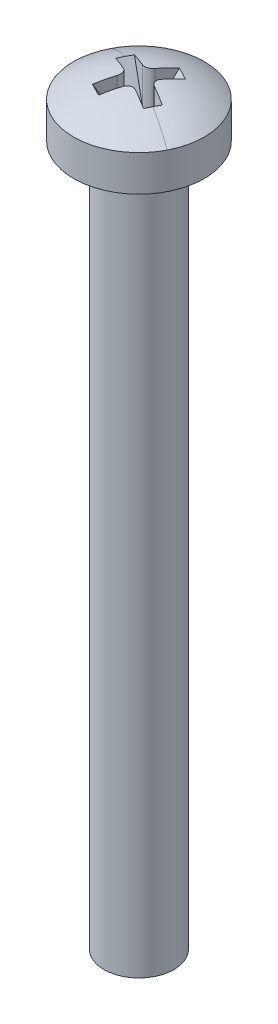
ISO-10303-21;
HEADER;
FILE_DESCRIPTION(('STEP AP214'),'2;1');
FILE_NAME('part.step','',(''),(''),'','','');
FILE_SCHEMA(('AUTOMOTIVE_DESIGN { 1 0 10303 214 1 1 1 1 }'));
ENDSEC;
DATA;
#1=APPLICATION_CONTEXT('core data for automotive mechanical design processes');
#2=APPLICATION_PROTOCOL_DEFINITION('international standard','automotive_design',2000,#1);
#3=PRODUCT_CONTEXT('',#1,'mechanical');
#4=PRODUCT('Part','Part','',(#3));
#5=PRODUCT_RELATED_PRODUCT_CATEGORY('part','',(#4));
#6=PRODUCT_DEFINITION_FORMATION('','',#4);
#7=PRODUCT_DEFINITION_CONTEXT('part definition',#1,'design');
#8=PRODUCT_DEFINITION('design','',#6,#7);
#9=PRODUCT_DEFINITION_SHAPE('','',#8);
#10=(LENGTH_UNIT() NAMED_UNIT(*) SI_UNIT(.MILLI.,.METRE.));
#11=(NAMED_UNIT(*) PLANE_ANGLE_UNIT() SI_UNIT($,.RADIAN.));
#12=(NAMED_UNIT(*) SI_UNIT($,.STERADIAN.) SOLID_ANGLE_UNIT());
#13=UNCERTAINTY_MEASURE_WITH_UNIT(LENGTH_MEASURE(1.E-05),#10,'distance_accuracy_value','');
#14=(GEOMETRIC_REPRESENTATION_CONTEXT(3) GLOBAL_UNCERTAINTY_ASSIGNED_CONTEXT((#13)) GLOBAL_UNIT_ASSIGNED_CONTEXT((#10,
#11,#12)) REPRESENTATION_CONTEXT('',''));
#15=CARTESIAN_POINT('',(0.,0.,0.));
#16=DIRECTION('',(0.,0.,1.));
#17=DIRECTION('',(1.,0.,0.));
#18=AXIS2_PLACEMENT_3D('',#15,#16,#17);
#19=CARTESIAN_POINT('',(-5.99075847111344,45.5704195270786,-64.1039085041195));
#20=DIRECTION('',(0.,-1.,0.));
#21=DIRECTION('',(1.,0.,0.));
#22=AXIS2_PLACEMENT_3D('',#19,#20,#21);
#23=PLANE('',#22);
#24=DIRECTION('',(0.45678408331748,0.,-0.889577597080665));
#25=VECTOR('',#24,1.);
#26=CARTESIAN_POINT('',(-6.47325458568408,45.5704195270786,-63.6678902764426));
#27=LINE('',#26,#25);
#28=CARTESIAN_POINT('',(-6.47325458568409,45.5704195270786,-63.6678902764426));
#29=VERTEX_POINT('',#28);
#30=CARTESIAN_POINT('',(-6.19163021265788,45.5704195270786,-64.2163479442679));
#31=VERTEX_POINT('',#30);
#32=EDGE_CURVE('E144',#29,#31,#27,.T.);
#33=ORIENTED_EDGE('',*,*,#32,.F.);
#34=CARTESIAN_POINT('',(-6.66873742522337,45.5704195270786,-63.4403238917421));
#35=DIRECTION('',(0.,-1.,0.));
#36=DIRECTION('',(1.,0.,0.));
#37=AXIS2_PLACEMENT_3D('',#34,#35,#36);
#38=CIRCLE('',#37,0.299999999999998);
#39=CARTESIAN_POINT('',(-6.37726836125233,45.5704195270786,-63.3692902043266));
#40=VERTEX_POINT('',#39);
#41=EDGE_CURVE('E324',#40,#29,#38,.F.);
#42=ORIENTED_EDGE('',*,*,#41,.F.);
#43=DIRECTION('',(-0.889577597080666,0.,-0.456784083317477));
#44=VECTOR('',#43,1.);
#45=CARTESIAN_POINT('',(-5.82881069342708,45.5704195270786,-63.0876658313004));
#46=LINE('',#45,#44);
#47=CARTESIAN_POINT('',(-5.82881069342707,45.5704195270786,-63.0876658313004));
#48=VERTEX_POINT('',#47);
#49=EDGE_CURVE('E170',#48,#40,#46,.T.);
#50=ORIENTED_EDGE('',*,*,#49,.F.);
#51=CARTESIAN_POINT('',(-5.60124430872657,45.5704195270786,-62.8921829917611));
#52=DIRECTION('',(0.,-1.,0.));
#53=DIRECTION('',(1.,0.,0.));
#54=AXIS2_PLACEMENT_3D('',#51,#52,#53);
#55=CIRCLE('',#54,0.299999999999998);
#56=CARTESIAN_POINT('',(-5.53021062131109,45.5704195270786,-63.1836520557322));
#57=VERTEX_POINT('',#56);
#58=EDGE_CURVE('E342',#57,#48,#55,.F.);
#59=ORIENTED_EDGE('',*,*,#58,.F.);
#60=DIRECTION('',(-0.456784083317481,0.,0.889577597080664));
#61=VECTOR('',#60,1.);
#62=CARTESIAN_POINT('',(-5.24858624828488,45.5704195270786,-63.7321097235574));
#63=LINE('',#62,#61);
#64=CARTESIAN_POINT('',(-5.24858624828488,45.5704195270786,-63.7321097235574));
#65=VERTEX_POINT('',#64);
#66=EDGE_CURVE('E174',#65,#57,#63,.T.);
#67=ORIENTED_EDGE('',*,*,#66,.F.);
#68=CARTESIAN_POINT('',(-5.0531034087456,45.5704195270786,-63.9596761082579));
#69=DIRECTION('',(0.,-1.,0.));
#70=DIRECTION('',(1.,0.,0.));
#71=AXIS2_PLACEMENT_3D('',#68,#69,#70);
#72=CIRCLE('',#71,0.299999999999998);
#73=CARTESIAN_POINT('',(-5.34457247271664,45.5704195270786,-64.0307097956734));
#74=VERTEX_POINT('',#73);
#75=EDGE_CURVE('E379',#74,#65,#72,.F.);
#76=ORIENTED_EDGE('',*,*,#75,.F.);
#77=DIRECTION('',(0.889577597080657,0.,0.456784083317495));
#78=VECTOR('',#77,1.);
#79=CARTESIAN_POINT('',(-5.89303014054189,45.5704195270786,-64.3123341686996));
#80=LINE('',#79,#78);
#81=CARTESIAN_POINT('',(-5.89303014054189,45.5704195270786,-64.3123341686996));
#82=VERTEX_POINT('',#81);
#83=EDGE_CURVE('E147',#82,#74,#80,.T.);
#84=ORIENTED_EDGE('',*,*,#83,.F.);
#85=CARTESIAN_POINT('',(-6.12059652524239,45.5704195270786,-64.5078170082389));
#86=DIRECTION('',(0.,-1.,0.));
#87=DIRECTION('',(1.,0.,0.));
#88=AXIS2_PLACEMENT_3D('',#85,#86,#87);
#89=CIRCLE('',#88,0.299999999999998);
#90=EDGE_CURVE('E21',#31,#82,#89,.F.);
#91=ORIENTED_EDGE('',*,*,#90,.F.);
#92=EDGE_LOOP('',(#33,#42,#50,#59,#67,#76,#84,#91));
#93=FACE_BOUND('',#92,.T.);
#94=ADVANCED_FACE('F18',(#93),#23,.F.);
#95=CARTESIAN_POINT('',(-6.12059652524239,45.5704195270786,-64.5078170082389));
#96=DIRECTION('',(0.,-1.,0.));
#97=DIRECTION('',(1.,0.,0.));
#98=AXIS2_PLACEMENT_3D('',#95,#96,#97);
#99=CYLINDRICAL_SURFACE('',#98,0.299999999999998);
#100=DIRECTION('',(0.,1.,0.));
#101=VECTOR('',#100,1.);
#102=CARTESIAN_POINT('',(-5.8537232461182,45.5704195270786,-64.3707817832437));
#103=LINE('',#102,#101);
#104=CARTESIAN_POINT('',(-5.85372324611809,47.2052151838135,-64.3707817832439));
#105=VERTEX_POINT('',#104);
#106=CARTESIAN_POINT('',(-5.8537232461182,45.6915738002666,-64.3707817832437));
#107=VERTEX_POINT('',#106);
#108=EDGE_CURVE('E471',#105,#107,#103,.F.);
#109=ORIENTED_EDGE('',*,*,#108,.F.);
#110=CARTESIAN_POINT('',(-5.85372324611797,47.2052151838135,-64.3707817832441));
#111=CARTESIAN_POINT('',(-5.86133816394046,47.2072391497238,-64.3559197222575));
#112=CARTESIAN_POINT('',(-5.87022810029549,47.2090920081056,-64.3416898597909));
#113=CARTESIAN_POINT('',(-5.89026616196918,47.2124095103203,-64.3148777604995));
#114=CARTESIAN_POINT('',(-5.90141341489537,47.2138743036267,-64.30229489024));
#115=CARTESIAN_POINT('',(-5.92569024937354,47.2163723024023,-64.2791387331639));
#116=CARTESIAN_POINT('',(-5.93882140343957,47.2174051630366,-64.2685670556464));
#117=CARTESIAN_POINT('',(-5.96668220598338,47.2190067962014,-64.2497616227292));
#118=CARTESIAN_POINT('',(-5.98141132740932,47.2195757212261,-64.2415270996949));
#119=CARTESIAN_POINT('',(-6.01193066503966,47.2202300218207,-64.2276914439237));
#120=CARTESIAN_POINT('',(-6.02771179453626,47.2203191028308,-64.2220704386826));
#121=CARTESIAN_POINT('',(-6.05998458234822,47.2200210020274,-64.2135301553134));
#122=CARTESIAN_POINT('',(-6.07647622577491,47.2196338301889,-64.2106108206013));
#123=CARTESIAN_POINT('',(-6.10964071949796,47.2183971460226,-64.2075563558061));
#124=CARTESIAN_POINT('',(-6.12631278109109,47.2175491814301,-64.2074119638093));
#125=CARTESIAN_POINT('',(-6.15942170451941,47.2154168278946,-64.2098776194737));
#126=CARTESIAN_POINT('',(-6.17585864924176,47.2141325969105,-64.2124866709154));
#127=CARTESIAN_POINT('',(-6.20334850594143,47.2115984533834,-64.2192165830731));
#128=CARTESIAN_POINT('',(-6.21457711846517,47.2104471601799,-64.2226771820594));
#129=CARTESIAN_POINT('',(-6.23652039330203,47.2079631810633,-64.2308713279406));
#130=CARTESIAN_POINT('',(-6.24723576919969,47.2066307575083,-64.2356030431909));
#131=CARTESIAN_POINT('',(-6.25763175023764,47.2052151838136,-64.2409437291147));
#132=B_SPLINE_CURVE_WITH_KNOTS('',3,(#110,#111,#112,#113,#114,#115,#116,#117,#118,#119,#120,
#121,#122,#123,#124,#125,#126,#127,#128,#129,#130,#131),.UNSPECIFIED.,.F.,.F.,(4,2,2,2,2,2,2,2,
2,2,4),(0.,0.0504039946641569,0.100788546583145,0.151213246756537,0.201621365804866,
0.251639660452755,0.301656907488732,0.351507183085358,0.401339428604923,0.436680554237757,
0.471971024908668),.UNSPECIFIED.);
#133=CARTESIAN_POINT('',(-6.25763175023764,47.2052151838136,-64.2409437291147));
#134=VERTEX_POINT('',#133);
#135=EDGE_CURVE('E150',#105,#134,#132,.T.);
#136=ORIENTED_EDGE('',*,*,#135,.T.);
#137=DIRECTION('',(0.,1.,0.));
#138=VECTOR('',#137,1.);
#139=CARTESIAN_POINT('',(-6.25763175023763,45.5704195270786,-64.2409437291147));
#140=LINE('',#139,#138);
#141=CARTESIAN_POINT('',(-6.25763175023764,45.6915738002666,-64.2409437291147));
#142=VERTEX_POINT('',#141);
#143=EDGE_CURVE('E156',#142,#134,#140,.T.);
#144=ORIENTED_EDGE('',*,*,#143,.F.);
#145=CARTESIAN_POINT('',(-6.12059652524239,45.6915738002666,-64.5078170082389));
#146=DIRECTION('',(0.770396797709372,0.500000000000001,0.395586620197326));
#147=DIRECTION('',(0.444788798540333,-0.866025403784438,0.228392041658741));
#148=AXIS2_PLACEMENT_3D('',#145,#146,#147);
#149=ELLIPSE('',#148,0.599999999999995,0.299999999999998);
#150=EDGE_CURVE('E152',#31,#142,#149,.F.);
#151=ORIENTED_EDGE('',*,*,#150,.F.);
#152=ORIENTED_EDGE('',*,*,#90,.T.);
#153=CARTESIAN_POINT('',(-6.12059652524239,45.6915738002666,-64.5078170082389));
#154=DIRECTION('',(-0.395586620197326,0.500000000000001,0.770396797709372));
#155=DIRECTION('',(-0.228392041658741,-0.866025403784438,0.444788798540333));
#156=AXIS2_PLACEMENT_3D('',#153,#154,#155);
#157=ELLIPSE('',#156,0.599999999999995,0.299999999999998);
#158=EDGE_CURVE('E179',#107,#82,#157,.F.);
#159=ORIENTED_EDGE('',*,*,#158,.F.);
#160=EDGE_LOOP('',(#109,#136,#144,#151,#152,#159));
#161=FACE_BOUND('',#160,.T.);
#162=ADVANCED_FACE('F154',(#161),#99,.T.);
#163=CARTESIAN_POINT('',(-5.17574429200826,47.2504195270786,-65.034366395621));
#164=DIRECTION('',(-0.395586620197326,0.500000000000001,0.770396797709372));
#165=DIRECTION('',(0.,-0.838820499650936,0.544408090833847));
#166=AXIS2_PLACEMENT_3D('',#163,#164,#165);
#167=PLANE('',#166);
#168=ORIENTED_EDGE('',*,*,#83,.T.);
#169=CARTESIAN_POINT('',(-5.0531034087456,45.6915738002666,-63.9596761082579));
#170=DIRECTION('',(-0.395586620197326,0.500000000000001,0.770396797709372));
#171=DIRECTION('',(-0.228392041658741,-0.866025403784438,0.444788798540333));
#172=AXIS2_PLACEMENT_3D('',#169,#170,#171);
#173=ELLIPSE('',#172,0.599999999999995,0.299999999999998);
#174=CARTESIAN_POINT('',(-5.3199766878698,45.6915738002666,-64.0967113332532));
#175=VERTEX_POINT('',#174);
#176=EDGE_CURVE('E178',#175,#74,#173,.T.);
#177=ORIENTED_EDGE('',*,*,#176,.F.);
#178=DIRECTION('',(-0.228392041658741,-0.866025403784438,0.444788798540333));
#179=VECTOR('',#178,1.);
#180=CARTESIAN_POINT('',(-4.96272146553195,47.0462273859704,-64.7924585228743));
#181=LINE('',#180,#179);
#182=CARTESIAN_POINT('',(-4.96272146553195,47.0462273859704,-64.7924585228744));
#183=VERTEX_POINT('',#182);
#184=EDGE_CURVE('E462',#183,#175,#181,.T.);
#185=ORIENTED_EDGE('',*,*,#184,.F.);
#186=CARTESIAN_POINT('',(-4.96272146553195,47.0462273859704,-64.7924585228744));
#187=CARTESIAN_POINT('',(-5.0502661956498,47.0515853639129,-64.8408887772388));
#188=CARTESIAN_POINT('',(-5.13851744056275,47.0542643528841,-64.8879431085869));
#189=CARTESIAN_POINT('',(-5.31643295997883,47.054264352884,-64.9792999252504));
#190=CARTESIAN_POINT('',(-5.40609723448197,47.0515853639128,-65.0236024105659));
#191=CARTESIAN_POINT('',(-5.49646802378019,47.0462273859703,-65.066528972865));
#192=B_SPLINE_CURVE_WITH_KNOTS('',3,(#186,#187,#188,#189,#190,#191),.UNSPECIFIED.,.F.,.F.,(4,2,
4),(0.,0.300143505315177,0.600287010630352),.UNSPECIFIED.);
#193=CARTESIAN_POINT('',(-5.49646802378028,47.0462273859704,-65.0665289728649));
#194=VERTEX_POINT('',#193);
#195=EDGE_CURVE('E384',#183,#194,#192,.T.);
#196=ORIENTED_EDGE('',*,*,#195,.T.);
#197=DIRECTION('',(0.228392041658738,0.866025403784442,-0.444788798540327));
#198=VECTOR('',#197,1.);
#199=CARTESIAN_POINT('',(-5.8537232461182,45.6915738002666,-64.3707817832437));
#200=LINE('',#199,#198);
#201=EDGE_CURVE('E468',#107,#194,#200,.T.);
#202=ORIENTED_EDGE('',*,*,#201,.F.);
#203=ORIENTED_EDGE('',*,*,#158,.T.);
#204=EDGE_LOOP('',(#168,#177,#185,#196,#202,#203));
#205=FACE_BOUND('',#204,.T.);
#206=ADVANCED_FACE('F393',(#205),#167,.T.);
#207=CARTESIAN_POINT('',(-5.0531034087456,45.5704195270786,-63.9596761082579));
#208=DIRECTION('',(0.,-1.,0.));
#209=DIRECTION('',(1.,0.,0.));
#210=AXIS2_PLACEMENT_3D('',#207,#208,#209);
#211=CYLINDRICAL_SURFACE('',#210,0.299999999999998);
#212=DIRECTION('',(0.,1.,0.));
#213=VECTOR('',#212,1.);
#214=CARTESIAN_POINT('',(-5.19013863374084,45.5704195270786,-63.6928028291337));
#215=LINE('',#214,#213);
#216=CARTESIAN_POINT('',(-5.19013863374084,47.2052151838136,-63.6928028291337));
#217=VERTEX_POINT('',#216);
#218=CARTESIAN_POINT('',(-5.19013863374084,45.6915738002666,-63.6928028291337));
#219=VERTEX_POINT('',#218);
#220=EDGE_CURVE('E459',#217,#219,#215,.F.);
#221=ORIENTED_EDGE('',*,*,#220,.F.);
#222=CARTESIAN_POINT('',(-5.19013863374084,47.2052151838136,-63.6928028291337));
#223=CARTESIAN_POINT('',(-5.20500069472743,47.2072391497239,-63.7004177469562));
#224=CARTESIAN_POINT('',(-5.21923055719406,47.2090920081056,-63.7093076833113));
#225=CARTESIAN_POINT('',(-5.24604265648538,47.2124095103203,-63.729345744985));
#226=CARTESIAN_POINT('',(-5.25862552674487,47.2138743036267,-63.7404929979113));
#227=CARTESIAN_POINT('',(-5.28178168382093,47.2163723024024,-63.7647698323895));
#228=CARTESIAN_POINT('',(-5.29235336133841,47.2174051630366,-63.7779009864555));
#229=CARTESIAN_POINT('',(-5.31115879425561,47.2190067962014,-63.8057617889993));
#230=CARTESIAN_POINT('',(-5.31939331728981,47.2195757212261,-63.8204909104253));
#231=CARTESIAN_POINT('',(-5.33322897306101,47.2202300218208,-63.8510102480556));
#232=CARTESIAN_POINT('',(-5.33884997830209,47.2203191028308,-63.8667913775523));
#233=CARTESIAN_POINT('',(-5.34739026167116,47.2200210020273,-63.8990641653642));
#234=CARTESIAN_POINT('',(-5.35030959638322,47.2196338301889,-63.9155558087909));
#235=CARTESIAN_POINT('',(-5.35336406117837,47.2183971460226,-63.948720302514));
#236=CARTESIAN_POINT('',(-5.35350845317518,47.2175491814301,-63.9653923641071));
#237=CARTESIAN_POINT('',(-5.35104279751071,47.2154168278946,-63.9985012875354));
#238=CARTESIAN_POINT('',(-5.34843374606896,47.2141325969105,-64.0149382322578));
#239=CARTESIAN_POINT('',(-5.34170383391125,47.2115984533834,-64.0424280889574));
#240=CARTESIAN_POINT('',(-5.33824323492495,47.2104471601799,-64.0536567014811));
#241=CARTESIAN_POINT('',(-5.33004908904374,47.2079631810633,-64.075599976318));
#242=CARTESIAN_POINT('',(-5.32531737379346,47.2066307575082,-64.0863153522157));
#243=CARTESIAN_POINT('',(-5.31997668786957,47.2052151838135,-64.0967113332536));
#244=B_SPLINE_CURVE_WITH_KNOTS('',3,(#222,#223,#224,#225,#226,#227,#228,#229,#230,#231,#232,
#233,#234,#235,#236,#237,#238,#239,#240,#241,#242,#243),.UNSPECIFIED.,.F.,.F.,(4,2,2,2,2,2,2,2,
2,2,4),(0.,0.0504039946641652,0.100788546583157,0.15121324675655,0.201621365804864,
0.251639660452754,0.301656907488725,0.351507183085339,0.401339428604909,0.436680554237725,
0.471971024908633),.UNSPECIFIED.);
#245=CARTESIAN_POINT('',(-5.31997668786969,47.2052151838135,-64.0967113332534));
#246=VERTEX_POINT('',#245);
#247=EDGE_CURVE('E373',#217,#246,#244,.T.);
#248=ORIENTED_EDGE('',*,*,#247,.T.);
#249=DIRECTION('',(0.,1.,0.));
#250=VECTOR('',#249,1.);
#251=CARTESIAN_POINT('',(-5.3199766878698,45.5704195270786,-64.0967113332532));
#252=LINE('',#251,#250);
#253=EDGE_CURVE('E465',#175,#246,#252,.T.);
#254=ORIENTED_EDGE('',*,*,#253,.F.);
#255=ORIENTED_EDGE('',*,*,#176,.T.);
#256=ORIENTED_EDGE('',*,*,#75,.T.);
#257=CARTESIAN_POINT('',(-5.0531034087456,45.6915738002666,-63.9596761082579));
#258=DIRECTION('',(-0.770396797709372,0.500000000000001,-0.395586620197326));
#259=DIRECTION('',(-0.444788798540333,-0.866025403784438,-0.228392041658741));
#260=AXIS2_PLACEMENT_3D('',#257,#258,#259);
#261=ELLIPSE('',#260,0.599999999999994,0.299999999999998);
#262=EDGE_CURVE('E177',#219,#65,#261,.F.);
#263=ORIENTED_EDGE('',*,*,#262,.F.);
#264=EDGE_LOOP('',(#221,#248,#254,#255,#256,#263));
#265=FACE_BOUND('',#264,.T.);
#266=ADVANCED_FACE('F353',(#265),#211,.T.);
#267=CARTESIAN_POINT('',(-4.52655402136349,47.2504195270786,-63.0148238750238));
#268=DIRECTION('',(-0.770396797709372,0.500000000000001,-0.395586620197326));
#269=DIRECTION('',(-0.544408090833847,-0.838820499650936,0.));
#270=AXIS2_PLACEMENT_3D('',#267,#268,#269);
#271=PLANE('',#270);
#272=CARTESIAN_POINT('',(-5.60124430872657,45.6915738002666,-62.8921829917611));
#273=DIRECTION('',(-0.770396797709372,0.500000000000001,-0.395586620197326));
#274=DIRECTION('',(-0.444788798540333,-0.866025403784438,-0.228392041658741));
#275=AXIS2_PLACEMENT_3D('',#272,#273,#274);
#276=ELLIPSE('',#275,0.599999999999994,0.299999999999998);
#277=CARTESIAN_POINT('',(-5.46420908373133,45.6915738002666,-63.1590562708853));
#278=VERTEX_POINT('',#277);
#279=EDGE_CURVE('E176',#278,#57,#276,.T.);
#280=ORIENTED_EDGE('',*,*,#279,.F.);
#281=DIRECTION('',(-0.444788798540327,-0.866025403784442,-0.228392041658738));
#282=VECTOR('',#281,1.);
#283=CARTESIAN_POINT('',(-4.76846189411017,47.0462273859704,-62.8018010485475));
#284=LINE('',#283,#282);
#285=CARTESIAN_POINT('',(-4.76846189411016,47.0462273859704,-62.8018010485475));
#286=VERTEX_POINT('',#285);
#287=EDGE_CURVE('E450',#286,#278,#284,.T.);
#288=ORIENTED_EDGE('',*,*,#287,.F.);
#289=CARTESIAN_POINT('',(-4.76846189411015,47.0462273859704,-62.8018010485475));
#290=CARTESIAN_POINT('',(-4.74426878174676,47.0489060546439,-62.8455309450389));
#291=CARTESIAN_POINT('',(-4.72040864272804,47.0509151362235,-62.8894587045129));
#292=CARTESIAN_POINT('',(-4.67335431137995,47.0535941251947,-62.9777099494258));
#293=CARTESIAN_POINT('',(-4.65016011905058,47.0542640325863,-63.0220334348648));
#294=CARTESIAN_POINT('',(-4.62729890006588,47.054264352884,-63.0665547832863));
#295=B_SPLINE_CURVE_WITH_KNOTS('',3,(#289,#290,#291,#292,#293,#294),.UNSPECIFIED.,.F.,.F.,(4,2,
4),(0.,0.150089694038878,0.300179388077747),.UNSPECIFIED.);
#296=CARTESIAN_POINT('',(-4.62729890006587,47.054264352884,-63.0665547832863));
#297=VERTEX_POINT('',#296);
#298=EDGE_CURVE('E366',#286,#297,#295,.T.);
#299=ORIENTED_EDGE('',*,*,#298,.T.);
#300=CARTESIAN_POINT('',(-4.62729890006587,47.054264352884,-63.0665547832863));
#301=CARTESIAN_POINT('',(-4.60443801008959,47.0542640325863,-63.1110763006485));
#302=CARTESIAN_POINT('',(-4.5819319437726,47.0535941251947,-63.1557531279554));
#303=CARTESIAN_POINT('',(-4.53762945845719,47.0509151362235,-63.2454174024586));
#304=CARTESIAN_POINT('',(-4.51583303945878,47.0489060546439,-63.2904048496549));
#305=CARTESIAN_POINT('',(-4.49439144411965,47.0462273859704,-63.3355476067959));
#306=B_SPLINE_CURVE_WITH_KNOTS('',3,(#300,#301,#302,#303,#304,#305),.UNSPECIFIED.,.F.,.F.,(4,2,
4),(0.,0.150089694038868,0.300179388077748),.UNSPECIFIED.);
#307=CARTESIAN_POINT('',(-4.49439144411966,47.0462273859704,-63.3355476067959));
#308=VERTEX_POINT('',#307);
#309=EDGE_CURVE('E359',#297,#308,#306,.T.);
#310=ORIENTED_EDGE('',*,*,#309,.T.);
#311=DIRECTION('',(0.444788798540329,0.866025403784441,0.228392041658738));
#312=VECTOR('',#311,1.);
#313=CARTESIAN_POINT('',(-5.19013863374084,45.6915738002666,-63.6928028291337));
#314=LINE('',#313,#312);
#315=EDGE_CURVE('E456',#219,#308,#314,.T.);
#316=ORIENTED_EDGE('',*,*,#315,.F.);
#317=ORIENTED_EDGE('',*,*,#262,.T.);
#318=ORIENTED_EDGE('',*,*,#66,.T.);
#319=EDGE_LOOP('',(#280,#288,#299,#310,#316,#317,#318));
#320=FACE_BOUND('',#319,.T.);
#321=ADVANCED_FACE('F348',(#320),#271,.T.);
#322=CARTESIAN_POINT('',(-5.60124430872657,45.5704195270786,-62.8921829917611));
#323=DIRECTION('',(0.,-1.,0.));
#324=DIRECTION('',(1.,0.,0.));
#325=AXIS2_PLACEMENT_3D('',#322,#323,#324);
#326=CYLINDRICAL_SURFACE('',#325,0.299999999999998);
#327=DIRECTION('',(0.,1.,0.));
#328=VECTOR('',#327,1.);
#329=CARTESIAN_POINT('',(-5.86811758785077,45.5704195270786,-63.0292182167564));
#330=LINE('',#329,#328);
#331=CARTESIAN_POINT('',(-5.86811758785088,47.2052151838135,-63.0292182167562));
#332=VERTEX_POINT('',#331);
#333=CARTESIAN_POINT('',(-5.86811758785077,45.6915738002666,-63.0292182167564));
#334=VERTEX_POINT('',#333);
#335=EDGE_CURVE('E447',#332,#334,#330,.F.);
#336=ORIENTED_EDGE('',*,*,#335,.F.);
#337=CARTESIAN_POINT('',(-5.86811758785098,47.2052151838135,-63.029218216756));
#338=CARTESIAN_POINT('',(-5.86050267002849,47.2072391497238,-63.0440802777426));
#339=CARTESIAN_POINT('',(-5.85161273367346,47.2090920081056,-63.0583101402092));
#340=CARTESIAN_POINT('',(-5.83157467199976,47.2124095103203,-63.0851222395006));
#341=CARTESIAN_POINT('',(-5.82042741907357,47.2138743036267,-63.0977051097601));
#342=CARTESIAN_POINT('',(-5.79615058459539,47.2163723024023,-63.1208612668362));
#343=CARTESIAN_POINT('',(-5.78301943052937,47.2174051630366,-63.1314329443537));
#344=CARTESIAN_POINT('',(-5.75515862798555,47.2190067962014,-63.1502383772709));
#345=CARTESIAN_POINT('',(-5.74042950655961,47.2195757212261,-63.1584729003051));
#346=CARTESIAN_POINT('',(-5.70991016892927,47.2202300218208,-63.1723085560764));
#347=CARTESIAN_POINT('',(-5.69412903943266,47.2203191028308,-63.1779295613175));
#348=CARTESIAN_POINT('',(-5.66185625162072,47.2200210020274,-63.1864698446866));
#349=CARTESIAN_POINT('',(-5.64536460819402,47.219633830189,-63.1893891793987));
#350=CARTESIAN_POINT('',(-5.61220011447098,47.2183971460226,-63.1924436441939));
#351=CARTESIAN_POINT('',(-5.59552805287785,47.2175491814301,-63.1925880361907));
#352=CARTESIAN_POINT('',(-5.56241912944953,47.2154168278946,-63.1901223805263));
#353=CARTESIAN_POINT('',(-5.54598218472719,47.2141325969105,-63.1875133290846));
#354=CARTESIAN_POINT('',(-5.51849232802751,47.2115984533834,-63.1807834169269));
#355=CARTESIAN_POINT('',(-5.50726371550378,47.2104471601799,-63.1773228179406));
#356=CARTESIAN_POINT('',(-5.48532044066692,47.2079631810633,-63.1691286720594));
#357=CARTESIAN_POINT('',(-5.47460506476928,47.2066307575083,-63.1643969568092));
#358=CARTESIAN_POINT('',(-5.46420908373134,47.2052151838136,-63.1590562708853));
#359=B_SPLINE_CURVE_WITH_KNOTS('',3,(#337,#338,#339,#340,#341,#342,#343,#344,#345,#346,#347,
#348,#349,#350,#351,#352,#353,#354,#355,#356,#357,#358),.UNSPECIFIED.,.F.,.F.,(4,2,2,2,2,2,2,2,
2,2,4),(0.,0.0504039946641759,0.100788546583152,0.151213246756542,0.201621365804877,
0.25163966045276,0.301656907488735,0.351507183085359,0.401339428604933,0.436680554237738,
0.471971024908617),.UNSPECIFIED.);
#360=CARTESIAN_POINT('',(-5.46420908373134,47.2052151838136,-63.1590562708853));
#361=VERTEX_POINT('',#360);
#362=EDGE_CURVE('E336',#332,#361,#359,.T.);
#363=ORIENTED_EDGE('',*,*,#362,.T.);
#364=DIRECTION('',(0.,1.,0.));
#365=VECTOR('',#364,1.);
#366=CARTESIAN_POINT('',(-5.46420908373133,45.5704195270786,-63.1590562708853));
#367=LINE('',#366,#365);
#368=EDGE_CURVE('E453',#278,#361,#367,.T.);
#369=ORIENTED_EDGE('',*,*,#368,.F.);
#370=ORIENTED_EDGE('',*,*,#279,.T.);
#371=ORIENTED_EDGE('',*,*,#58,.T.);
#372=CARTESIAN_POINT('',(-5.60124430872657,45.6915738002666,-62.8921829917611));
#373=DIRECTION('',(0.395586620197326,0.500000000000001,-0.770396797709373));
#374=DIRECTION('',(0.228392041658741,-0.866025403784438,-0.444788798540333));
#375=AXIS2_PLACEMENT_3D('',#372,#373,#374);
#376=ELLIPSE('',#375,0.599999999999995,0.299999999999998);
#377=EDGE_CURVE('E173',#334,#48,#376,.F.);
#378=ORIENTED_EDGE('',*,*,#377,.F.);
#379=EDGE_LOOP('',(#336,#363,#369,#370,#371,#378));
#380=FACE_BOUND('',#379,.T.);
#381=ADVANCED_FACE('F344',(#380),#326,.T.);
#382=CARTESIAN_POINT('',(-6.54609654196071,47.2504195270786,-62.365633604379));
#383=DIRECTION('',(0.395586620197326,0.500000000000001,-0.770396797709373));
#384=DIRECTION('',(0.,0.838820499650936,0.544408090833847));
#385=AXIS2_PLACEMENT_3D('',#382,#383,#384);
#386=PLANE('',#385);
#387=ORIENTED_EDGE('',*,*,#49,.T.);
#388=CARTESIAN_POINT('',(-6.66873742522337,45.6915738002666,-63.4403238917421));
#389=DIRECTION('',(0.395586620197326,0.500000000000001,-0.770396797709373));
#390=DIRECTION('',(0.228392041658741,-0.866025403784438,-0.444788798540333));
#391=AXIS2_PLACEMENT_3D('',#388,#389,#390);
#392=ELLIPSE('',#391,0.599999999999995,0.299999999999998);
#393=CARTESIAN_POINT('',(-6.40186414609917,45.6915738002666,-63.3032886667469));
#394=VERTEX_POINT('',#393);
#395=EDGE_CURVE('E172',#394,#40,#392,.T.);
#396=ORIENTED_EDGE('',*,*,#395,.F.);
#397=DIRECTION('',(0.22839204165874,-0.866025403784438,-0.444788798540333));
#398=VECTOR('',#397,1.);
#399=CARTESIAN_POINT('',(-6.75911936843702,47.0462273859704,-62.6075414771257));
#400=LINE('',#399,#398);
#401=CARTESIAN_POINT('',(-6.75911936843702,47.0462273859704,-62.6075414771257));
#402=VERTEX_POINT('',#401);
#403=EDGE_CURVE('E438',#402,#394,#400,.T.);
#404=ORIENTED_EDGE('',*,*,#403,.F.);
#405=CARTESIAN_POINT('',(-6.75911936843703,47.0462273859704,-62.6075414771257));
#406=CARTESIAN_POINT('',(-6.67157463831917,47.0515853639129,-62.5591112227613));
#407=CARTESIAN_POINT('',(-6.58332339340622,47.0542643528841,-62.5120568914132));
#408=CARTESIAN_POINT('',(-6.40540787399013,47.054264352884,-62.4207000747496));
#409=CARTESIAN_POINT('',(-6.315743599487,47.0515853639128,-62.3763975894341));
#410=CARTESIAN_POINT('',(-6.22537281018877,47.0462273859703,-62.333471027135));
#411=B_SPLINE_CURVE_WITH_KNOTS('',3,(#405,#406,#407,#408,#409,#410),.UNSPECIFIED.,.F.,.F.,(4,2,
4),(0.,0.300143505315188,0.600287010630378),.UNSPECIFIED.);
#412=CARTESIAN_POINT('',(-6.2253728101887,47.0462273859704,-62.3334710271351));
#413=VERTEX_POINT('',#412);
#414=EDGE_CURVE('E330',#402,#413,#411,.T.);
#415=ORIENTED_EDGE('',*,*,#414,.T.);
#416=DIRECTION('',(-0.228392041658739,0.86602540378444,0.44478879854033));
#417=VECTOR('',#416,1.);
#418=CARTESIAN_POINT('',(-5.86811758785077,45.6915738002666,-63.0292182167564));
#419=LINE('',#418,#417);
#420=EDGE_CURVE('E444',#334,#413,#419,.T.);
#421=ORIENTED_EDGE('',*,*,#420,.F.);
#422=ORIENTED_EDGE('',*,*,#377,.T.);
#423=EDGE_LOOP('',(#387,#396,#404,#415,#421,#422));
#424=FACE_BOUND('',#423,.T.);
#425=ADVANCED_FACE('F314',(#424),#386,.T.);
#426=CARTESIAN_POINT('',(-6.66873742522337,45.5704195270786,-63.4403238917421));
#427=DIRECTION('',(0.,-1.,0.));
#428=DIRECTION('',(1.,0.,0.));
#429=AXIS2_PLACEMENT_3D('',#426,#427,#428);
#430=CYLINDRICAL_SURFACE('',#429,0.299999999999998);
#431=DIRECTION('',(0.,1.,0.));
#432=VECTOR('',#431,1.);
#433=CARTESIAN_POINT('',(-6.53170220022813,45.5704195270786,-63.7071971708663));
#434=LINE('',#433,#432);
#435=CARTESIAN_POINT('',(-6.53170220022813,47.2052151838136,-63.7071971708663));
#436=VERTEX_POINT('',#435);
#437=CARTESIAN_POINT('',(-6.53170220022813,45.6915738002666,-63.7071971708663));
#438=VERTEX_POINT('',#437);
#439=EDGE_CURVE('E435',#436,#438,#434,.F.);
#440=ORIENTED_EDGE('',*,*,#439,.F.);
#441=CARTESIAN_POINT('',(-6.53170220022813,47.2052151838136,-63.7071971708663));
#442=CARTESIAN_POINT('',(-6.51684013924155,47.2072391497239,-63.6995822530438));
#443=CARTESIAN_POINT('',(-6.50261027677492,47.2090920081057,-63.6906923166887));
#444=CARTESIAN_POINT('',(-6.47579817748359,47.2124095103203,-63.670654255015));
#445=CARTESIAN_POINT('',(-6.46321530722409,47.2138743036267,-63.6595070020888));
#446=CARTESIAN_POINT('',(-6.44005915014803,47.2163723024024,-63.6352301676106));
#447=CARTESIAN_POINT('',(-6.42948747263056,47.2174051630366,-63.6220990135445));
#448=CARTESIAN_POINT('',(-6.41068203971337,47.2190067962014,-63.5942382110007));
#449=CARTESIAN_POINT('',(-6.40244751667917,47.2195757212261,-63.5795090895747));
#450=CARTESIAN_POINT('',(-6.38861186090797,47.2202300218207,-63.5489897519444));
#451=CARTESIAN_POINT('',(-6.38299085566689,47.2203191028308,-63.5332086224478));
#452=CARTESIAN_POINT('',(-6.37445057229781,47.2200210020273,-63.5009358346358));
#453=CARTESIAN_POINT('',(-6.37153123758576,47.2196338301889,-63.4844441912091));
#454=CARTESIAN_POINT('',(-6.3684767727906,47.2183971460226,-63.451279697486));
#455=CARTESIAN_POINT('',(-6.3683323807938,47.2175491814301,-63.4346076358929));
#456=CARTESIAN_POINT('',(-6.37079803645825,47.2154168278946,-63.4014987124646));
#457=CARTESIAN_POINT('',(-6.3734070879,47.2141325969105,-63.3850617677423));
#458=CARTESIAN_POINT('',(-6.38013700005772,47.2115984533834,-63.3575719110426));
#459=CARTESIAN_POINT('',(-6.38359759904403,47.2104471601799,-63.3463432985189));
#460=CARTESIAN_POINT('',(-6.39179174492524,47.2079631810633,-63.324400023682));
#461=CARTESIAN_POINT('',(-6.39652346017551,47.2066307575083,-63.3136846477843));
#462=CARTESIAN_POINT('',(-6.40186414609939,47.2052151838135,-63.3032886667464));
#463=B_SPLINE_CURVE_WITH_KNOTS('',3,(#441,#442,#443,#444,#445,#446,#447,#448,#449,#450,#451,
#452,#453,#454,#455,#456,#457,#458,#459,#460,#461,#462),.UNSPECIFIED.,.F.,.F.,(4,2,2,2,2,2,2,2,
2,2,4),(0.,0.0504039946641631,0.100788546583145,0.151213246756556,0.201621365804877,
0.251639660452756,0.301656907488726,0.351507183085354,0.40133942860491,0.436680554237742,
0.471971024908647),.UNSPECIFIED.);
#464=CARTESIAN_POINT('',(-6.40186414609928,47.2052151838135,-63.3032886667466));
#465=VERTEX_POINT('',#464);
#466=EDGE_CURVE('E318',#436,#465,#463,.T.);
#467=ORIENTED_EDGE('',*,*,#466,.T.);
#468=DIRECTION('',(0.,1.,0.));
#469=VECTOR('',#468,1.);
#470=CARTESIAN_POINT('',(-6.40186414609917,45.5704195270786,-63.3032886667469));
#471=LINE('',#470,#469);
#472=EDGE_CURVE('E441',#394,#465,#471,.T.);
#473=ORIENTED_EDGE('',*,*,#472,.F.);
#474=ORIENTED_EDGE('',*,*,#395,.T.);
#475=ORIENTED_EDGE('',*,*,#41,.T.);
#476=CARTESIAN_POINT('',(-6.66873742522337,45.6915738002666,-63.4403238917421));
#477=DIRECTION('',(0.770396797709372,0.500000000000001,0.395586620197326));
#478=DIRECTION('',(0.444788798540333,-0.866025403784438,0.228392041658741));
#479=AXIS2_PLACEMENT_3D('',#476,#477,#478);
#480=ELLIPSE('',#479,0.599999999999995,0.299999999999998);
#481=EDGE_CURVE('E163',#438,#29,#480,.F.);
#482=ORIENTED_EDGE('',*,*,#481,.F.);
#483=EDGE_LOOP('',(#440,#467,#473,#474,#475,#482));
#484=FACE_BOUND('',#483,.T.);
#485=ADVANCED_FACE('F309',(#484),#430,.T.);
#486=CARTESIAN_POINT('',(-7.19528681260548,47.2504195270786,-64.3851761249762));
#487=DIRECTION('',(0.770396797709372,0.500000000000001,0.395586620197326));
#488=DIRECTION('',(-0.544408090833847,0.838820499650936,0.));
#489=AXIS2_PLACEMENT_3D('',#486,#487,#488);
#490=PLANE('',#489);
#491=ORIENTED_EDGE('',*,*,#150,.T.);
#492=DIRECTION('',(0.444788798540332,-0.866025403784438,0.228392041658746));
#493=VECTOR('',#492,1.);
#494=CARTESIAN_POINT('',(-6.95337893985881,47.0462273859704,-64.5981989514526));
#495=LINE('',#494,#493);
#496=CARTESIAN_POINT('',(-6.95337893985882,47.0462273859704,-64.5981989514525));
#497=VERTEX_POINT('',#496);
#498=EDGE_CURVE('E473',#497,#142,#495,.T.);
#499=ORIENTED_EDGE('',*,*,#498,.F.);
#500=CARTESIAN_POINT('',(-6.95337893985882,47.0462273859704,-64.5981989514525));
#501=CARTESIAN_POINT('',(-6.97757205222221,47.0489060546439,-64.5544690549611));
#502=CARTESIAN_POINT('',(-7.00143219124093,47.0509151362235,-64.5105412954872));
#503=CARTESIAN_POINT('',(-7.04848652258902,47.0535941251947,-64.4222900505742));
#504=CARTESIAN_POINT('',(-7.07168071491839,47.0542640325864,-64.3779665651352));
#505=CARTESIAN_POINT('',(-7.09454193390309,47.054264352884,-64.3334452167137));
#506=B_SPLINE_CURVE_WITH_KNOTS('',3,(#500,#501,#502,#503,#504,#505),.UNSPECIFIED.,.F.,.F.,(4,2,
4),(0.,0.150089694038868,0.300179388077747),.UNSPECIFIED.);
#507=CARTESIAN_POINT('',(-7.09454193390309,47.054264352884,-64.3334452167137));
#508=VERTEX_POINT('',#507);
#509=EDGE_CURVE('E300',#497,#508,#506,.T.);
#510=ORIENTED_EDGE('',*,*,#509,.T.);
#511=CARTESIAN_POINT('',(-7.09454193390309,47.054264352884,-64.3334452167137));
#512=CARTESIAN_POINT('',(-7.11740282387936,47.0542640325863,-64.2889236993515));
#513=CARTESIAN_POINT('',(-7.13990889019636,47.0535941251947,-64.2442468720446));
#514=CARTESIAN_POINT('',(-7.18421137551177,47.0509151362235,-64.1545825975414));
#515=CARTESIAN_POINT('',(-7.20600779451019,47.0489060546439,-64.1095951503452));
#516=CARTESIAN_POINT('',(-7.22744938984932,47.0462273859704,-64.0644523932042));
#517=B_SPLINE_CURVE_WITH_KNOTS('',3,(#511,#512,#513,#514,#515,#516),.UNSPECIFIED.,.F.,.F.,(4,2,
4),(0.,0.150089694038884,0.300179388077772),.UNSPECIFIED.);
#518=CARTESIAN_POINT('',(-7.2274493898493,47.0462273859704,-64.0644523932042));
#519=VERTEX_POINT('',#518);
#520=EDGE_CURVE('E165',#508,#519,#517,.T.);
#521=ORIENTED_EDGE('',*,*,#520,.T.);
#522=DIRECTION('',(-0.444788798540332,0.866025403784439,-0.228392041658738));
#523=VECTOR('',#522,1.);
#524=CARTESIAN_POINT('',(-6.53170220022813,45.6915738002666,-63.7071971708663));
#525=LINE('',#524,#523);
#526=EDGE_CURVE('E293',#438,#519,#525,.T.);
#527=ORIENTED_EDGE('',*,*,#526,.F.);
#528=ORIENTED_EDGE('',*,*,#481,.T.);
#529=ORIENTED_EDGE('',*,*,#32,.T.);
#530=EDGE_LOOP('',(#491,#499,#510,#521,#527,#528,#529));
#531=FACE_BOUND('',#530,.T.);
#532=ADVANCED_FACE('F161',(#531),#490,.T.);
#533=CARTESIAN_POINT('',(-5.99075847111344,45.5704195270786,-64.1039085041195));
#534=DIRECTION('',(-0.456784083317481,0.,0.889577597080664));
#535=DIRECTION('',(0.889577597080664,0.,0.456784083317481));
#536=AXIS2_PLACEMENT_3D('',#533,#534,#535);
#537=PLANE('',#536);
#538=CARTESIAN_POINT('',(-6.9533789398588,47.0462273859704,-64.5981989514526));
#539=CARTESIAN_POINT('',(-6.83930878649283,47.0831642737427,-64.5396257245523));
#540=CARTESIAN_POINT('',(-6.72429477734142,47.1148817007824,-64.4805678425741));
#541=CARTESIAN_POINT('',(-6.4923790474677,47.1678776333968,-64.3614827684615));
#542=CARTESIAN_POINT('',(-6.37547732674539,47.1891561389715,-64.3014555763271));
#543=CARTESIAN_POINT('',(-6.25763175023763,47.2052151838136,-64.2409437291147));
#544=B_SPLINE_CURVE_WITH_KNOTS('',3,(#538,#539,#540,#541,#542,#543),.UNSPECIFIED.,.F.,.F.,(4,2,
4),(0.,0.399372580588285,0.798745161176574),.UNSPECIFIED.);
#545=EDGE_CURVE('E287',#497,#134,#544,.T.);
#546=ORIENTED_EDGE('',*,*,#545,.F.);
#547=ORIENTED_EDGE('',*,*,#498,.T.);
#548=ORIENTED_EDGE('',*,*,#143,.T.);
#549=EDGE_LOOP('',(#546,#547,#548));
#550=FACE_BOUND('',#549,.T.);
#551=ADVANCED_FACE('F276',(#550),#537,.T.);
#552=CARTESIAN_POINT('',(-5.99075847111344,45.5704195270786,-64.1039085041195));
#553=DIRECTION('',(0.889577597080664,0.,0.456784083317481));
#554=DIRECTION('',(0.456784083317481,0.,-0.889577597080664));
#555=AXIS2_PLACEMENT_3D('',#552,#553,#554);
#556=PLANE('',#555);
#557=ORIENTED_EDGE('',*,*,#201,.T.);
#558=CARTESIAN_POINT('',(-5.85372324611798,47.2052151838135,-64.3707817832441));
#559=CARTESIAN_POINT('',(-5.79321139890562,47.1891561389714,-64.4886273597518));
#560=CARTESIAN_POINT('',(-5.73318420677131,47.1678776333968,-64.605529080474));
#561=CARTESIAN_POINT('',(-5.61409913265878,47.1148817007824,-64.8374448103476));
#562=CARTESIAN_POINT('',(-5.55504125068056,47.0831642737427,-64.9524588194989));
#563=CARTESIAN_POINT('',(-5.49646802378038,47.0462273859704,-65.0665289728648));
#564=B_SPLINE_CURVE_WITH_KNOTS('',3,(#558,#559,#560,#561,#562,#563),.UNSPECIFIED.,.F.,.F.,(4,2,
4),(0.,0.399372580588001,0.798745161176024),.UNSPECIFIED.);
#565=EDGE_CURVE('E280',#105,#194,#564,.T.);
#566=ORIENTED_EDGE('',*,*,#565,.F.);
#567=ORIENTED_EDGE('',*,*,#108,.T.);
#568=EDGE_LOOP('',(#557,#566,#567));
#569=FACE_BOUND('',#568,.T.);
#570=ADVANCED_FACE('F271',(#569),#556,.T.);
#571=CARTESIAN_POINT('',(-5.45701191286504,45.5704195270786,-63.829838054129));
#572=DIRECTION('',(-0.889577597080664,0.,-0.456784083317481));
#573=DIRECTION('',(-0.456784083317481,0.,0.889577597080664));
#574=AXIS2_PLACEMENT_3D('',#571,#572,#573);
#575=PLANE('',#574);
#576=CARTESIAN_POINT('',(-4.96272146553195,47.0462273859704,-64.7924585228744));
#577=CARTESIAN_POINT('',(-5.02129469243211,47.0831642737427,-64.6783883695085));
#578=CARTESIAN_POINT('',(-5.08035257441032,47.1148817007824,-64.5633743603572));
#579=CARTESIAN_POINT('',(-5.19943764852283,47.1678776333967,-64.3314586304837));
#580=CARTESIAN_POINT('',(-5.25946484065713,47.1891561389714,-64.2145569097615));
#581=CARTESIAN_POINT('',(-5.31997668786946,47.2052151838135,-64.0967113332538));
#582=B_SPLINE_CURVE_WITH_KNOTS('',3,(#576,#577,#578,#579,#580,#581),.UNSPECIFIED.,.F.,.F.,(4,2,
4),(0.,0.399372580587936,0.798745161175868),.UNSPECIFIED.);
#583=EDGE_CURVE('E256',#183,#246,#582,.T.);
#584=ORIENTED_EDGE('',*,*,#583,.F.);
#585=ORIENTED_EDGE('',*,*,#184,.T.);
#586=ORIENTED_EDGE('',*,*,#253,.T.);
#587=EDGE_LOOP('',(#584,#585,#586));
#588=FACE_BOUND('',#587,.T.);
#589=ADVANCED_FACE('F266',(#588),#575,.T.);
#590=CARTESIAN_POINT('',(-5.45701191286504,45.5704195270786,-63.829838054129));
#591=DIRECTION('',(-0.456784083317481,0.,0.889577597080664));
#592=DIRECTION('',(0.889577597080664,0.,0.456784083317481));
#593=AXIS2_PLACEMENT_3D('',#590,#591,#592);
#594=PLANE('',#593);
#595=ORIENTED_EDGE('',*,*,#315,.T.);
#596=CARTESIAN_POINT('',(-5.19013863374084,47.2052151838136,-63.6928028291337));
#597=CARTESIAN_POINT('',(-5.07229305723307,47.1891561389715,-63.6322909819214));
#598=CARTESIAN_POINT('',(-4.95539133651077,47.1678776333968,-63.572263789787));
#599=CARTESIAN_POINT('',(-4.72347560663711,47.1148817007824,-63.4531787156744));
#600=CARTESIAN_POINT('',(-4.60846159748575,47.0831642737427,-63.394120833696));
#601=CARTESIAN_POINT('',(-4.49439144411985,47.0462273859705,-63.3355476067957));
#602=B_SPLINE_CURVE_WITH_KNOTS('',3,(#596,#597,#598,#599,#600,#601),.UNSPECIFIED.,.F.,.F.,(4,2,
4),(0.,0.399372580588256,0.798745161176513),.UNSPECIFIED.);
#603=EDGE_CURVE('E248',#217,#308,#602,.T.);
#604=ORIENTED_EDGE('',*,*,#603,.F.);
#605=ORIENTED_EDGE('',*,*,#220,.T.);
#606=EDGE_LOOP('',(#595,#604,#605));
#607=FACE_BOUND('',#606,.T.);
#608=ADVANCED_FACE('F263',(#607),#594,.T.);
#609=CARTESIAN_POINT('',(-5.73108236285553,45.5704195270786,-63.2960914958806));
#610=DIRECTION('',(0.456784083317481,0.,-0.889577597080664));
#611=DIRECTION('',(-0.889577597080664,0.,-0.456784083317481));
#612=AXIS2_PLACEMENT_3D('',#609,#610,#611);
#613=PLANE('',#612);
#614=CARTESIAN_POINT('',(-4.76846189411016,47.0462273859704,-62.8018010485475));
#615=CARTESIAN_POINT('',(-4.88253204747612,47.0831642737427,-62.8603742754477));
#616=CARTESIAN_POINT('',(-4.99754605662753,47.1148817007824,-62.919432157426));
#617=CARTESIAN_POINT('',(-5.22946178650125,47.1678776333968,-63.0385172315386));
#618=CARTESIAN_POINT('',(-5.34636350722356,47.1891561389715,-63.0985444236729));
#619=CARTESIAN_POINT('',(-5.46420908373132,47.2052151838136,-63.1590562708853));
#620=B_SPLINE_CURVE_WITH_KNOTS('',3,(#614,#615,#616,#617,#618,#619),.UNSPECIFIED.,.F.,.F.,(4,2,
4),(0.,0.399372580588288,0.798745161176576),.UNSPECIFIED.);
#621=EDGE_CURVE('E241',#286,#361,#620,.T.);
#622=ORIENTED_EDGE('',*,*,#621,.F.);
#623=ORIENTED_EDGE('',*,*,#287,.T.);
#624=ORIENTED_EDGE('',*,*,#368,.T.);
#625=EDGE_LOOP('',(#622,#623,#624));
#626=FACE_BOUND('',#625,.T.);
#627=ADVANCED_FACE('F230',(#626),#613,.T.);
#628=CARTESIAN_POINT('',(-5.73108236285553,45.5704195270786,-63.2960914958806));
#629=DIRECTION('',(-0.889577597080664,0.,-0.456784083317481));
#630=DIRECTION('',(-0.456784083317481,0.,0.889577597080664));
#631=AXIS2_PLACEMENT_3D('',#628,#629,#630);
#632=PLANE('',#631);
#633=ORIENTED_EDGE('',*,*,#420,.T.);
#634=CARTESIAN_POINT('',(-5.868117587851,47.2052151838135,-63.029218216756));
#635=CARTESIAN_POINT('',(-5.92862943506335,47.1891561389714,-62.9113726402483));
#636=CARTESIAN_POINT('',(-5.98865662719765,47.1678776333968,-62.7944709195261));
#637=CARTESIAN_POINT('',(-6.10774170131018,47.1148817007824,-62.5625551896525));
#638=CARTESIAN_POINT('',(-6.16679958328841,47.0831642737427,-62.4475411805012));
#639=CARTESIAN_POINT('',(-6.2253728101886,47.0462273859704,-62.3334710271353));
#640=B_SPLINE_CURVE_WITH_KNOTS('',3,(#634,#635,#636,#637,#638,#639),.UNSPECIFIED.,.F.,.F.,(4,2,
4),(0.,0.399372580588008,0.798745161176035),.UNSPECIFIED.);
#641=EDGE_CURVE('E234',#332,#413,#640,.T.);
#642=ORIENTED_EDGE('',*,*,#641,.F.);
#643=ORIENTED_EDGE('',*,*,#335,.T.);
#644=EDGE_LOOP('',(#633,#642,#643));
#645=FACE_BOUND('',#644,.T.);
#646=ADVANCED_FACE('F225',(#645),#632,.T.);
#647=CARTESIAN_POINT('',(-6.26482892110393,45.5704195270786,-63.5701619458711));
#648=DIRECTION('',(0.889577597080664,0.,0.456784083317481));
#649=DIRECTION('',(0.456784083317481,0.,-0.889577597080664));
#650=AXIS2_PLACEMENT_3D('',#647,#648,#649);
#651=PLANE('',#650);
#652=CARTESIAN_POINT('',(-6.75911936843702,47.0462273859704,-62.6075414771257));
#653=CARTESIAN_POINT('',(-6.70054614153686,47.0831642737427,-62.7216116304915));
#654=CARTESIAN_POINT('',(-6.64148825955865,47.1148817007824,-62.8366256396429));
#655=CARTESIAN_POINT('',(-6.52240318544615,47.1678776333967,-63.0685413695164));
#656=CARTESIAN_POINT('',(-6.46237599331185,47.1891561389714,-63.1854430902386));
#657=CARTESIAN_POINT('',(-6.40186414609951,47.2052151838135,-63.3032886667462));
#658=B_SPLINE_CURVE_WITH_KNOTS('',3,(#652,#653,#654,#655,#656,#657),.UNSPECIFIED.,.F.,.F.,(4,2,
4),(0.,0.39937258058792,0.798745161175829),.UNSPECIFIED.);
#659=EDGE_CURVE('E200',#402,#465,#658,.T.);
#660=ORIENTED_EDGE('',*,*,#659,.F.);
#661=ORIENTED_EDGE('',*,*,#403,.T.);
#662=ORIENTED_EDGE('',*,*,#472,.T.);
#663=EDGE_LOOP('',(#660,#661,#662));
#664=FACE_BOUND('',#663,.T.);
#665=ADVANCED_FACE('F217',(#664),#651,.T.);
#666=CARTESIAN_POINT('',(-6.26482892110393,45.5704195270786,-63.5701619458711));
#667=DIRECTION('',(0.456784083317481,0.,-0.889577597080664));
#668=DIRECTION('',(-0.889577597080664,0.,-0.456784083317481));
#669=AXIS2_PLACEMENT_3D('',#666,#667,#668);
#670=PLANE('',#669);
#671=ORIENTED_EDGE('',*,*,#526,.T.);
#672=CARTESIAN_POINT('',(-6.53170220022813,47.2052151838136,-63.7071971708663));
#673=CARTESIAN_POINT('',(-6.64954777673589,47.1891561389715,-63.7677090180787));
#674=CARTESIAN_POINT('',(-6.76644949745819,47.1678776333968,-63.827736210213));
#675=CARTESIAN_POINT('',(-6.99836522733185,47.1148817007824,-63.9468212843257));
#676=CARTESIAN_POINT('',(-7.11337923648322,47.0831642737427,-64.005879166304));
#677=CARTESIAN_POINT('',(-7.22744938984912,47.0462273859705,-64.0644523932044));
#678=B_SPLINE_CURVE_WITH_KNOTS('',3,(#672,#673,#674,#675,#676,#677),.UNSPECIFIED.,.F.,.F.,(4,2,
4),(0.,0.399372580588256,0.798745161176518),.UNSPECIFIED.);
#679=EDGE_CURVE('E191',#436,#519,#678,.T.);
#680=ORIENTED_EDGE('',*,*,#679,.F.);
#681=ORIENTED_EDGE('',*,*,#439,.T.);
#682=EDGE_LOOP('',(#671,#680,#681));
#683=FACE_BOUND('',#682,.T.);
#684=ADVANCED_FACE('F213',(#683),#670,.T.);
#685=CARTESIAN_POINT('',(-8.35805218224779,46.3880757602581,-64.9822378262021));
#686=CARTESIAN_POINT('',(-7.97740523748484,46.3880757602582,-65.7235399136108));
#687=CARTESIAN_POINT('',(-7.61346511254065,46.1437091683175,-66.4323058134157));
#688=CARTESIAN_POINT('',(-7.29824859177795,45.676371032919,-67.0461834972958));
#689=CARTESIAN_POINT('',(-6.80143755041968,47.5752117943061,-64.182940732827));
#690=CARTESIAN_POINT('',(-6.31157909099421,47.5752117943061,-65.1369299963769));
#691=CARTESIAN_POINT('',(-5.84322080943938,47.2607339194406,-66.0490481062121));
#692=CARTESIAN_POINT('',(-5.43756543410874,46.6593116771587,-66.839053597228));
#693=CARTESIAN_POINT('',(-4.92040328354931,47.5752117943061,-63.2170592671731));
#694=CARTESIAN_POINT('',(-4.43054482412384,47.5752117943061,-64.1710485307229));
#695=CARTESIAN_POINT('',(-3.96218654256901,47.2607339194406,-65.0831666405582));
#696=CARTESIAN_POINT('',(-3.55653116723837,46.6593116771587,-65.8731721315742));
#697=CARTESIAN_POINT('',(-3.36378865172121,46.3880757602581,-62.417762173798));
#698=CARTESIAN_POINT('',(-2.98314170695825,46.3880757602582,-63.1590642612067));
#699=CARTESIAN_POINT('',(-2.61920158201406,46.1437091683175,-63.8678301610116));
#700=CARTESIAN_POINT('',(-2.30398506125136,45.676371032919,-64.4817078448917));
#701=(BOUNDED_SURFACE() B_SPLINE_SURFACE(3,3,((#685,#686,#687,#688),(#689,#690,#691,#692),(#693,
#694,#695,#696),(#697,#698,#699,#700)),.UNSPECIFIED.,.F.,.F.,
.F.) B_SPLINE_SURFACE_WITH_KNOTS((4,4),(4,4),(0.00478317736563424,0.99521682263436),(0.,
0.995459579502849),
.UNSPECIFIED.) GEOMETRIC_REPRESENTATION_ITEM() RATIONAL_B_SPLINE_SURFACE(((0.998328919023149,
0.968938117955659,0.968804671360064,0.997928579236366),(0.883541889615656,0.857530418428487,
0.857412315411547,0.883187580564838),(0.883541889615655,0.857530418428486,0.857412315411547,
0.883187580564837),(0.998328919023147,0.968938117955657,0.968804671360062,0.997928579236364))) REPRESENTATION_ITEM('') SURFACE());
#702=CARTESIAN_POINT('',(-5.86092041698448,42.2504195270786,-63.7000000000001));
#703=DIRECTION('',(-0.456784083317471,0.,0.889577597080669));
#704=DIRECTION('',(0.88957759708067,0.,0.456784083317471));
#705=AXIS2_PLACEMENT_3D('',#702,#703,#704);
#706=CIRCLE('',#705,5.00000000000001);
#707=CARTESIAN_POINT('',(-3.37010314515862,46.3928825625202,-62.4210045667111));
#708=VERTEX_POINT('',#707);
#709=EDGE_CURVE('E36',#708,#297,#706,.T.);
#710=CARTESIAN_POINT('',(-5.86092041698448,46.3928825625202,-63.7));
#711=DIRECTION('',(0.,1.,0.));
#712=DIRECTION('',(-1.,0.,0.));
#713=AXIS2_PLACEMENT_3D('',#710,#711,#712);
#714=CIRCLE('',#713,2.8);
#715=CARTESIAN_POINT('',(-8.35173768881036,46.3928825625202,-64.978995433289));
#716=VERTEX_POINT('',#715);
#717=EDGE_CURVE('E188',#716,#708,#714,.F.);
#718=CARTESIAN_POINT('',(-5.86092041698448,42.2504195270786,-63.7000000000001));
#719=DIRECTION('',(-0.456784083317471,0.,0.889577597080669));
#720=DIRECTION('',(0.88957759708067,0.,0.456784083317471));
#721=AXIS2_PLACEMENT_3D('',#718,#719,#720);
#722=CIRCLE('',#721,5.00000000000001);
#723=EDGE_CURVE('E255',#508,#716,#722,.T.);
#724=ORIENTED_EDGE('',*,*,#709,.F.);
#725=ORIENTED_EDGE('',*,*,#717,.F.);
#726=ORIENTED_EDGE('',*,*,#723,.F.);
#727=ORIENTED_EDGE('',*,*,#509,.F.);
#728=ORIENTED_EDGE('',*,*,#545,.T.);
#729=ORIENTED_EDGE('',*,*,#135,.F.);
#730=ORIENTED_EDGE('',*,*,#565,.T.);
#731=ORIENTED_EDGE('',*,*,#195,.F.);
#732=ORIENTED_EDGE('',*,*,#583,.T.);
#733=ORIENTED_EDGE('',*,*,#247,.F.);
#734=ORIENTED_EDGE('',*,*,#603,.T.);
#735=ORIENTED_EDGE('',*,*,#309,.F.);
#736=EDGE_LOOP('',(#724,#725,#726,#727,#728,#729,#730,#731,#732,#733,#734,#735));
#737=FACE_BOUND('',#736,.T.);
#738=ADVANCED_FACE('F216',(#737),#701,.T.);
#739=CARTESIAN_POINT('',(-9.41785577271762,45.676371032919,-62.9182921551083));
#740=CARTESIAN_POINT('',(-9.10263925195491,46.1437091683175,-63.5321698389884));
#741=CARTESIAN_POINT('',(-8.73869912701072,46.3880757602582,-64.2409357387934));
#742=CARTESIAN_POINT('',(-8.35805218224777,46.3880757602581,-64.9822378262021));
#743=CARTESIAN_POINT('',(-8.16530966673061,46.6593116771587,-61.5268278684259));
#744=CARTESIAN_POINT('',(-7.75965429139996,47.2607339194406,-62.3168333594418));
#745=CARTESIAN_POINT('',(-7.29129600984512,47.5752117943061,-63.2289514692771));
#746=CARTESIAN_POINT('',(-6.80143755041965,47.5752117943061,-64.182940732827));
#747=CARTESIAN_POINT('',(-6.28427539986022,46.6593116771587,-60.560946402772));
#748=CARTESIAN_POINT('',(-5.87862002452958,47.2607339194406,-61.3509518937879));
#749=CARTESIAN_POINT('',(-5.41026174297475,47.5752117943061,-62.2630700036232));
#750=CARTESIAN_POINT('',(-4.92040328354926,47.5752117943061,-63.217059267173));
#751=CARTESIAN_POINT('',(-4.42359224219101,45.676371032919,-60.3538165027042));
#752=CARTESIAN_POINT('',(-4.1083757214283,46.1437091683175,-60.9676941865843));
#753=CARTESIAN_POINT('',(-3.74443559648412,46.3880757602581,-61.6764600863892));
#754=CARTESIAN_POINT('',(-3.36378865172116,46.3880757602581,-62.417762173798));
#755=(BOUNDED_SURFACE() B_SPLINE_SURFACE(3,3,((#739,#740,#741,#742),(#743,#744,#745,#746),(#747,
#748,#749,#750),(#751,#752,#753,#754)),.UNSPECIFIED.,.F.,.F.,
.F.) B_SPLINE_SURFACE_WITH_KNOTS((4,4),(4,4),(0.00478317736564163,0.99521682263437),
(0.00454042049714352,1.),
.UNSPECIFIED.) GEOMETRIC_REPRESENTATION_ITEM() RATIONAL_B_SPLINE_SURFACE(((0.997928579236364,
0.968804671360062,0.968938117955656,0.998328919023147),(0.883187580564837,0.857412315411546,
0.857530418428485,0.883541889615654),(0.883187580564838,0.857412315411547,0.857530418428486,
0.883541889615655),(0.997928579236368,0.968804671360066,0.96893811795566,0.998328919023151))) REPRESENTATION_ITEM('') SURFACE());
#756=CARTESIAN_POINT('',(-5.86092041698448,46.3928825625202,-63.7));
#757=DIRECTION('',(0.,1.,0.));
#758=DIRECTION('',(-1.,0.,0.));
#759=AXIS2_PLACEMENT_3D('',#756,#757,#758);
#760=CIRCLE('',#759,2.8);
#761=EDGE_CURVE('E186',#708,#716,#760,.F.);
#762=ORIENTED_EDGE('',*,*,#679,.T.);
#763=ORIENTED_EDGE('',*,*,#520,.F.);
#764=ORIENTED_EDGE('',*,*,#723,.T.);
#765=ORIENTED_EDGE('',*,*,#761,.F.);
#766=ORIENTED_EDGE('',*,*,#709,.T.);
#767=ORIENTED_EDGE('',*,*,#298,.F.);
#768=ORIENTED_EDGE('',*,*,#621,.T.);
#769=ORIENTED_EDGE('',*,*,#362,.F.);
#770=ORIENTED_EDGE('',*,*,#641,.T.);
#771=ORIENTED_EDGE('',*,*,#414,.F.);
#772=ORIENTED_EDGE('',*,*,#659,.T.);
#773=ORIENTED_EDGE('',*,*,#466,.F.);
#774=EDGE_LOOP('',(#762,#763,#764,#765,#766,#767,#768,#769,#770,#771,#772,#773));
#775=FACE_BOUND('',#774,.T.);
#776=ADVANCED_FACE('F207',(#775),#755,.T.);
#777=CARTESIAN_POINT('',(-5.86092041698448,42.7346066161972,-63.7));
#778=DIRECTION('',(0.,1.,0.));
#779=DIRECTION('',(-1.,0.,0.));
#780=AXIS2_PLACEMENT_3D('',#777,#778,#779);
#781=CYLINDRICAL_SURFACE('',#780,2.8);
#782=CARTESIAN_POINT('',(-5.86092041698448,44.8504195270786,-63.7));
#783=DIRECTION('',(0.,1.,0.));
#784=DIRECTION('',(-1.,0.,0.));
#785=AXIS2_PLACEMENT_3D('',#782,#783,#784);
#786=CIRCLE('',#785,2.8);
#787=CARTESIAN_POINT('',(-8.66092041698448,44.8504195270786,-63.7));
#788=VERTEX_POINT('',#787);
#789=EDGE_CURVE('E183',#788,#788,#786,.F.);
#790=ORIENTED_EDGE('',*,*,#789,.F.);
#791=EDGE_LOOP('',(#790));
#792=FACE_BOUND('',#791,.T.);
#793=ORIENTED_EDGE('',*,*,#717,.T.);
#794=ORIENTED_EDGE('',*,*,#761,.T.);
#795=EDGE_LOOP('',(#793,#794));
#796=FACE_BOUND('',#795,.T.);
#797=ADVANCED_FACE('F417',(#792,#796),#781,.T.);
#798=CARTESIAN_POINT('',(-7.46216009172968,44.8504195270786,-64.5222113499715));
#799=DIRECTION('',(0.,-1.,0.));
#800=DIRECTION('',(1.,0.,0.));
#801=AXIS2_PLACEMENT_3D('',#798,#799,#800);
#802=PLANE('',#801);
#803=CARTESIAN_POINT('',(-5.86092041698448,44.8504195270786,-63.7));
#804=DIRECTION('',(0.,1.,0.));
#805=DIRECTION('',(-1.,0.,0.));
#806=AXIS2_PLACEMENT_3D('',#803,#804,#805);
#807=CIRCLE('',#806,1.5);
#808=CARTESIAN_POINT('',(-7.36092041698448,44.8504195270786,-63.7));
#809=VERTEX_POINT('',#808);
#810=EDGE_CURVE('E27',#809,#809,#807,.F.);
#811=ORIENTED_EDGE('',*,*,#810,.F.);
#812=EDGE_LOOP('',(#811));
#813=FACE_BOUND('',#812,.T.);
#814=ORIENTED_EDGE('',*,*,#789,.T.);
#815=EDGE_LOOP('',(#814));
#816=FACE_BOUND('',#815,.T.);
#817=ADVANCED_FACE('F411',(#813,#816),#802,.T.);
#818=CARTESIAN_POINT('',(-7.19528681260549,14.8504195270786,-64.3851761249762));
#819=DIRECTION('',(0.,-1.,0.));
#820=DIRECTION('',(1.,0.,0.));
#821=AXIS2_PLACEMENT_3D('',#818,#819,#820);
#822=PLANE('',#821);
#823=CARTESIAN_POINT('',(-5.86092041698448,14.8504195270786,-63.7));
#824=DIRECTION('',(0.,1.,0.));
#825=DIRECTION('',(-1.,0.,0.));
#826=AXIS2_PLACEMENT_3D('',#823,#824,#825);
#827=CIRCLE('',#826,1.5);
#828=CARTESIAN_POINT('',(-7.36092041698449,14.8504195270786,-63.7));
#829=VERTEX_POINT('',#828);
#830=EDGE_CURVE('E11',#829,#829,#827,.T.);
#831=ORIENTED_EDGE('',*,*,#830,.F.);
#832=EDGE_LOOP('',(#831));
#833=FACE_BOUND('',#832,.T.);
#834=ADVANCED_FACE('F405',(#833),#822,.T.);
#835=CARTESIAN_POINT('',(-5.86092041698448,42.7346066161972,-63.7));
#836=DIRECTION('',(0.,1.,0.));
#837=DIRECTION('',(-1.,0.,0.));
#838=AXIS2_PLACEMENT_3D('',#835,#836,#837);
#839=CYLINDRICAL_SURFACE('',#838,1.5);
#840=ORIENTED_EDGE('',*,*,#810,.T.);
#841=EDGE_LOOP('',(#840));
#842=FACE_BOUND('',#841,.T.);
#843=ORIENTED_EDGE('',*,*,#830,.T.);
#844=EDGE_LOOP('',(#843));
#845=FACE_BOUND('',#844,.T.);
#846=ADVANCED_FACE('F403',(#842,#845),#839,.T.);
#847=CLOSED_SHELL('',(#94,#162,#206,#266,#321,#381,#425,#485,#532,#551,#570,#589,#608,#627,#646,
#665,#684,#738,#776,#797,#817,#834,#846));
#848=MANIFOLD_SOLID_BREP('B1',#847);
#849=ADVANCED_BREP_SHAPE_REPRESENTATION('',(#18,#848),#14);
#850=SHAPE_DEFINITION_REPRESENTATION(#9,#849);
ENDSEC;
END-ISO-10303-21;
